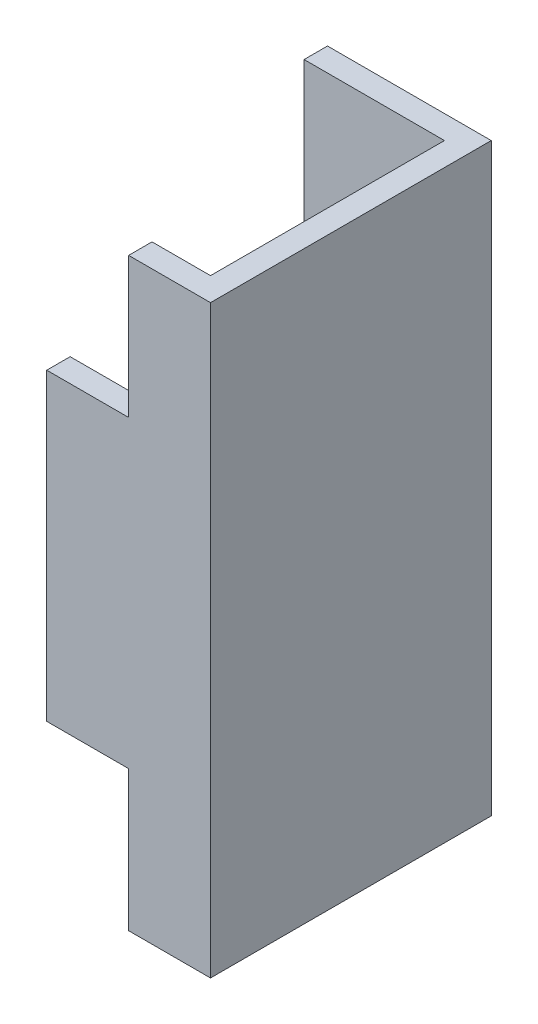
ISO-10303-21;
HEADER;
FILE_DESCRIPTION(('STEP AP214'),'2;1');
FILE_NAME('part.step','',(''),(''),'','','');
FILE_SCHEMA(('AUTOMOTIVE_DESIGN { 1 0 10303 214 1 1 1 1 }'));
ENDSEC;
DATA;
#1=APPLICATION_CONTEXT('core data for automotive mechanical design processes');
#2=APPLICATION_PROTOCOL_DEFINITION('international standard','automotive_design',2000,#1);
#3=PRODUCT_CONTEXT('',#1,'mechanical');
#4=PRODUCT('Part','Part','',(#3));
#5=PRODUCT_RELATED_PRODUCT_CATEGORY('part','',(#4));
#6=PRODUCT_DEFINITION_FORMATION('','',#4);
#7=PRODUCT_DEFINITION_CONTEXT('part definition',#1,'design');
#8=PRODUCT_DEFINITION('design','',#6,#7);
#9=PRODUCT_DEFINITION_SHAPE('','',#8);
#10=(LENGTH_UNIT() NAMED_UNIT(*) SI_UNIT(.MILLI.,.METRE.));
#11=(NAMED_UNIT(*) PLANE_ANGLE_UNIT() SI_UNIT($,.RADIAN.));
#12=(NAMED_UNIT(*) SI_UNIT($,.STERADIAN.) SOLID_ANGLE_UNIT());
#13=UNCERTAINTY_MEASURE_WITH_UNIT(LENGTH_MEASURE(1.E-05),#10,'distance_accuracy_value','');
#14=(GEOMETRIC_REPRESENTATION_CONTEXT(3) GLOBAL_UNCERTAINTY_ASSIGNED_CONTEXT((#13)) GLOBAL_UNIT_ASSIGNED_CONTEXT((#10,
#11,#12)) REPRESENTATION_CONTEXT('',''));
#15=CARTESIAN_POINT('',(0.,0.,0.));
#16=DIRECTION('',(0.,0.,1.));
#17=DIRECTION('',(1.,0.,0.));
#18=AXIS2_PLACEMENT_3D('',#15,#16,#17);
#19=CARTESIAN_POINT('',(0.,1.94462219947249,0.549999999999999));
#20=DIRECTION('',(0.,0.,1.));
#21=DIRECTION('',(1.,0.,0.));
#22=AXIS2_PLACEMENT_3D('',#19,#20,#21);
#23=PLANE('',#22);
#24=DIRECTION('',(0.,1.,0.));
#25=VECTOR('',#24,1.);
#26=CARTESIAN_POINT('',(1.775,0.95,0.549999999999999));
#27=LINE('',#26,#25);
#28=CARTESIAN_POINT('',(1.775,0.95,0.549999999999999));
#29=VERTEX_POINT('',#28);
#30=CARTESIAN_POINT('',(1.775,1.25,0.55));
#31=VERTEX_POINT('',#30);
#32=EDGE_CURVE('E11',#29,#31,#27,.T.);
#33=ORIENTED_EDGE('',*,*,#32,.F.);
#34=DIRECTION('',(1.,0.,0.));
#35=VECTOR('',#34,1.);
#36=CARTESIAN_POINT('',(1.6,0.95,0.549999999999999));
#37=LINE('',#36,#35);
#38=CARTESIAN_POINT('',(1.6,0.95,0.549999999999999));
#39=VERTEX_POINT('',#38);
#40=EDGE_CURVE('E200',#39,#29,#37,.T.);
#41=ORIENTED_EDGE('',*,*,#40,.F.);
#42=DIRECTION('',(0.,-1.,0.));
#43=VECTOR('',#42,1.);
#44=CARTESIAN_POINT('',(1.6,0.95,0.55));
#45=LINE('',#44,#43);
#46=CARTESIAN_POINT('',(1.6,0.3,0.549999999999999));
#47=VERTEX_POINT('',#46);
#48=EDGE_CURVE('E193',#39,#47,#45,.T.);
#49=ORIENTED_EDGE('',*,*,#48,.T.);
#50=DIRECTION('',(-1.,0.,0.));
#51=VECTOR('',#50,1.);
#52=CARTESIAN_POINT('',(1.775,0.3,0.549999999999999));
#53=LINE('',#52,#51);
#54=CARTESIAN_POINT('',(1.775,0.3,0.549999999999999));
#55=VERTEX_POINT('',#54);
#56=EDGE_CURVE('E184',#55,#47,#53,.T.);
#57=ORIENTED_EDGE('',*,*,#56,.F.);
#58=DIRECTION('',(0.,1.,0.));
#59=VECTOR('',#58,1.);
#60=CARTESIAN_POINT('',(1.775,0.,0.549999999999999));
#61=LINE('',#60,#59);
#62=CARTESIAN_POINT('',(1.775,0.,0.549999999999999));
#63=VERTEX_POINT('',#62);
#64=EDGE_CURVE('E122',#63,#55,#61,.T.);
#65=ORIENTED_EDGE('',*,*,#64,.F.);
#66=DIRECTION('',(-1.,0.,0.));
#67=VECTOR('',#66,1.);
#68=CARTESIAN_POINT('',(1.95,0.,0.55));
#69=LINE('',#68,#67);
#70=CARTESIAN_POINT('',(1.95,0.,0.55));
#71=VERTEX_POINT('',#70);
#72=EDGE_CURVE('E165',#71,#63,#69,.T.);
#73=ORIENTED_EDGE('',*,*,#72,.F.);
#74=DIRECTION('',(0.,-1.,0.));
#75=VECTOR('',#74,1.);
#76=CARTESIAN_POINT('',(1.95,1.25,0.55));
#77=LINE('',#76,#75);
#78=CARTESIAN_POINT('',(1.95,1.25,0.55));
#79=VERTEX_POINT('',#78);
#80=EDGE_CURVE('E195',#79,#71,#77,.T.);
#81=ORIENTED_EDGE('',*,*,#80,.F.);
#82=DIRECTION('',(1.,0.,0.));
#83=VECTOR('',#82,1.);
#84=CARTESIAN_POINT('',(1.775,1.25,0.55));
#85=LINE('',#84,#83);
#86=EDGE_CURVE('E146',#31,#79,#85,.T.);
#87=ORIENTED_EDGE('',*,*,#86,.F.);
#88=EDGE_LOOP('',(#33,#41,#49,#57,#65,#73,#81,#87));
#89=FACE_BOUND('',#88,.T.);
#90=ADVANCED_FACE('F17',(#89),#23,.T.);
#91=CARTESIAN_POINT('',(1.95,1.94462219947249,0.));
#92=DIRECTION('',(1.,0.,0.));
#93=DIRECTION('',(0.,0.,-1.));
#94=AXIS2_PLACEMENT_3D('',#91,#92,#93);
#95=PLANE('',#94);
#96=DIRECTION('',(0.,0.,-1.));
#97=VECTOR('',#96,1.);
#98=CARTESIAN_POINT('',(1.95,1.25,0.55));
#99=LINE('',#98,#97);
#100=CARTESIAN_POINT('',(1.95,1.25,-0.0499999999999999));
#101=VERTEX_POINT('',#100);
#102=EDGE_CURVE('E24',#79,#101,#99,.T.);
#103=ORIENTED_EDGE('',*,*,#102,.F.);
#104=ORIENTED_EDGE('',*,*,#80,.T.);
#105=DIRECTION('',(0.,0.,1.));
#106=VECTOR('',#105,1.);
#107=CARTESIAN_POINT('',(1.95,0.,-0.0499999999999999));
#108=LINE('',#107,#106);
#109=CARTESIAN_POINT('',(1.95,0.,-0.0499999999999999));
#110=VERTEX_POINT('',#109);
#111=EDGE_CURVE('E186',#110,#71,#108,.T.);
#112=ORIENTED_EDGE('',*,*,#111,.F.);
#113=DIRECTION('',(0.,-1.,0.));
#114=VECTOR('',#113,1.);
#115=CARTESIAN_POINT('',(1.95,1.25,-0.0499999999999999));
#116=LINE('',#115,#114);
#117=EDGE_CURVE('E189',#101,#110,#116,.T.);
#118=ORIENTED_EDGE('',*,*,#117,.F.);
#119=EDGE_LOOP('',(#103,#104,#112,#118));
#120=FACE_BOUND('',#119,.T.);
#121=ADVANCED_FACE('F209',(#120),#95,.T.);
#122=CARTESIAN_POINT('',(0.,1.94462219947249,-0.0500000000000001));
#123=DIRECTION('',(0.,0.,-1.));
#124=DIRECTION('',(-1.,0.,0.));
#125=AXIS2_PLACEMENT_3D('',#122,#123,#124);
#126=PLANE('',#125);
#127=DIRECTION('',(-1.,0.,0.));
#128=VECTOR('',#127,1.);
#129=CARTESIAN_POINT('',(1.95,1.25,-0.0499999999999999));
#130=LINE('',#129,#128);
#131=CARTESIAN_POINT('',(1.6,1.25,-0.0499999999999999));
#132=VERTEX_POINT('',#131);
#133=EDGE_CURVE('E197',#101,#132,#130,.T.);
#134=ORIENTED_EDGE('',*,*,#133,.F.);
#135=ORIENTED_EDGE('',*,*,#117,.T.);
#136=DIRECTION('',(1.,0.,0.));
#137=VECTOR('',#136,1.);
#138=CARTESIAN_POINT('',(1.6,0.,-0.0499999999999999));
#139=LINE('',#138,#137);
#140=CARTESIAN_POINT('',(1.6,0.,-0.0499999999999999));
#141=VERTEX_POINT('',#140);
#142=EDGE_CURVE('E177',#141,#110,#139,.T.);
#143=ORIENTED_EDGE('',*,*,#142,.F.);
#144=DIRECTION('',(0.,-1.,0.));
#145=VECTOR('',#144,1.);
#146=CARTESIAN_POINT('',(1.6,1.25,-0.0499999999999999));
#147=LINE('',#146,#145);
#148=EDGE_CURVE('E168',#132,#141,#147,.T.);
#149=ORIENTED_EDGE('',*,*,#148,.F.);
#150=EDGE_LOOP('',(#134,#135,#143,#149));
#151=FACE_BOUND('',#150,.T.);
#152=ADVANCED_FACE('F216',(#151),#126,.T.);
#153=CARTESIAN_POINT('',(1.6,1.94462219947249,0.));
#154=DIRECTION('',(1.,0.,0.));
#155=DIRECTION('',(0.,0.,-1.));
#156=AXIS2_PLACEMENT_3D('',#153,#154,#155);
#157=PLANE('',#156);
#158=DIRECTION('',(0.,-1.,0.));
#159=VECTOR('',#158,1.);
#160=CARTESIAN_POINT('',(1.6,1.25,0.));
#161=LINE('',#160,#159);
#162=CARTESIAN_POINT('',(1.6,1.25,0.));
#163=VERTEX_POINT('',#162);
#164=CARTESIAN_POINT('',(1.6,0.,0.));
#165=VERTEX_POINT('',#164);
#166=EDGE_CURVE('E191',#163,#165,#161,.T.);
#167=ORIENTED_EDGE('',*,*,#166,.F.);
#168=DIRECTION('',(0.,0.,-1.));
#169=VECTOR('',#168,1.);
#170=CARTESIAN_POINT('',(1.6,1.25,0.));
#171=LINE('',#170,#169);
#172=EDGE_CURVE('E180',#163,#132,#171,.T.);
#173=ORIENTED_EDGE('',*,*,#172,.T.);
#174=ORIENTED_EDGE('',*,*,#148,.T.);
#175=DIRECTION('',(0.,0.,1.));
#176=VECTOR('',#175,1.);
#177=CARTESIAN_POINT('',(1.6,0.,-0.0499999999999999));
#178=LINE('',#177,#176);
#179=EDGE_CURVE('E157',#141,#165,#178,.T.);
#180=ORIENTED_EDGE('',*,*,#179,.T.);
#181=EDGE_LOOP('',(#167,#173,#174,#180));
#182=FACE_BOUND('',#181,.T.);
#183=ADVANCED_FACE('F218',(#182),#157,.F.);
#184=CARTESIAN_POINT('',(0.,1.94462219947249,0.));
#185=DIRECTION('',(0.,0.,-1.));
#186=DIRECTION('',(-1.,0.,0.));
#187=AXIS2_PLACEMENT_3D('',#184,#185,#186);
#188=PLANE('',#187);
#189=DIRECTION('',(0.,-1.,0.));
#190=VECTOR('',#189,1.);
#191=CARTESIAN_POINT('',(1.9,1.25,0.));
#192=LINE('',#191,#190);
#193=CARTESIAN_POINT('',(1.9,1.25,0.));
#194=VERTEX_POINT('',#193);
#195=CARTESIAN_POINT('',(1.9,0.,0.));
#196=VERTEX_POINT('',#195);
#197=EDGE_CURVE('E182',#194,#196,#192,.T.);
#198=ORIENTED_EDGE('',*,*,#197,.F.);
#199=DIRECTION('',(-1.,0.,0.));
#200=VECTOR('',#199,1.);
#201=CARTESIAN_POINT('',(1.9,1.25,0.));
#202=LINE('',#201,#200);
#203=EDGE_CURVE('E171',#194,#163,#202,.T.);
#204=ORIENTED_EDGE('',*,*,#203,.T.);
#205=ORIENTED_EDGE('',*,*,#166,.T.);
#206=DIRECTION('',(1.,0.,0.));
#207=VECTOR('',#206,1.);
#208=CARTESIAN_POINT('',(1.6,0.,0.));
#209=LINE('',#208,#207);
#210=EDGE_CURVE('E149',#165,#196,#209,.T.);
#211=ORIENTED_EDGE('',*,*,#210,.T.);
#212=EDGE_LOOP('',(#198,#204,#205,#211));
#213=FACE_BOUND('',#212,.T.);
#214=ADVANCED_FACE('F222',(#213),#188,.F.);
#215=CARTESIAN_POINT('',(1.9,1.94462219947249,0.));
#216=DIRECTION('',(1.,0.,0.));
#217=DIRECTION('',(0.,0.,-1.));
#218=AXIS2_PLACEMENT_3D('',#215,#216,#217);
#219=PLANE('',#218);
#220=DIRECTION('',(0.,-1.,0.));
#221=VECTOR('',#220,1.);
#222=CARTESIAN_POINT('',(1.9,1.25,0.5));
#223=LINE('',#222,#221);
#224=CARTESIAN_POINT('',(1.9,1.25,0.5));
#225=VERTEX_POINT('',#224);
#226=CARTESIAN_POINT('',(1.9,0.,0.5));
#227=VERTEX_POINT('',#226);
#228=EDGE_CURVE('E174',#225,#227,#223,.T.);
#229=ORIENTED_EDGE('',*,*,#228,.F.);
#230=DIRECTION('',(0.,0.,-1.));
#231=VECTOR('',#230,1.);
#232=CARTESIAN_POINT('',(1.9,1.25,0.5));
#233=LINE('',#232,#231);
#234=EDGE_CURVE('E160',#225,#194,#233,.T.);
#235=ORIENTED_EDGE('',*,*,#234,.T.);
#236=ORIENTED_EDGE('',*,*,#197,.T.);
#237=DIRECTION('',(0.,0.,1.));
#238=VECTOR('',#237,1.);
#239=CARTESIAN_POINT('',(1.9,0.,0.));
#240=LINE('',#239,#238);
#241=EDGE_CURVE('E137',#196,#227,#240,.T.);
#242=ORIENTED_EDGE('',*,*,#241,.T.);
#243=EDGE_LOOP('',(#229,#235,#236,#242));
#244=FACE_BOUND('',#243,.T.);
#245=ADVANCED_FACE('F225',(#244),#219,.F.);
#246=CARTESIAN_POINT('',(0.,1.94462219947249,0.5));
#247=DIRECTION('',(0.,0.,1.));
#248=DIRECTION('',(1.,0.,0.));
#249=AXIS2_PLACEMENT_3D('',#246,#247,#248);
#250=PLANE('',#249);
#251=DIRECTION('',(1.,0.,0.));
#252=VECTOR('',#251,1.);
#253=CARTESIAN_POINT('',(1.6,0.95,0.5));
#254=LINE('',#253,#252);
#255=CARTESIAN_POINT('',(1.6,0.95,0.5));
#256=VERTEX_POINT('',#255);
#257=CARTESIAN_POINT('',(1.775,0.95,0.5));
#258=VERTEX_POINT('',#257);
#259=EDGE_CURVE('E163',#256,#258,#254,.T.);
#260=ORIENTED_EDGE('',*,*,#259,.T.);
#261=DIRECTION('',(0.,1.,0.));
#262=VECTOR('',#261,1.);
#263=CARTESIAN_POINT('',(1.775,0.95,0.5));
#264=LINE('',#263,#262);
#265=CARTESIAN_POINT('',(1.775,1.25,0.5));
#266=VERTEX_POINT('',#265);
#267=EDGE_CURVE('E152',#258,#266,#264,.T.);
#268=ORIENTED_EDGE('',*,*,#267,.T.);
#269=DIRECTION('',(1.,0.,0.));
#270=VECTOR('',#269,1.);
#271=CARTESIAN_POINT('',(1.775,1.25,0.5));
#272=LINE('',#271,#270);
#273=EDGE_CURVE('E139',#266,#225,#272,.T.);
#274=ORIENTED_EDGE('',*,*,#273,.T.);
#275=ORIENTED_EDGE('',*,*,#228,.T.);
#276=DIRECTION('',(-1.,0.,0.));
#277=VECTOR('',#276,1.);
#278=CARTESIAN_POINT('',(1.9,0.,0.5));
#279=LINE('',#278,#277);
#280=CARTESIAN_POINT('',(1.775,0.,0.5));
#281=VERTEX_POINT('',#280);
#282=EDGE_CURVE('E113',#227,#281,#279,.T.);
#283=ORIENTED_EDGE('',*,*,#282,.T.);
#284=DIRECTION('',(0.,1.,0.));
#285=VECTOR('',#284,1.);
#286=CARTESIAN_POINT('',(1.775,0.,0.5));
#287=LINE('',#286,#285);
#288=CARTESIAN_POINT('',(1.775,0.3,0.5));
#289=VERTEX_POINT('',#288);
#290=EDGE_CURVE('E104',#281,#289,#287,.T.);
#291=ORIENTED_EDGE('',*,*,#290,.T.);
#292=DIRECTION('',(-1.,0.,0.));
#293=VECTOR('',#292,1.);
#294=CARTESIAN_POINT('',(1.775,0.3,0.5));
#295=LINE('',#294,#293);
#296=CARTESIAN_POINT('',(1.6,0.3,0.5));
#297=VERTEX_POINT('',#296);
#298=EDGE_CURVE('E109',#289,#297,#295,.T.);
#299=ORIENTED_EDGE('',*,*,#298,.T.);
#300=DIRECTION('',(0.,-1.,0.));
#301=VECTOR('',#300,1.);
#302=CARTESIAN_POINT('',(1.6,0.95,0.5));
#303=LINE('',#302,#301);
#304=EDGE_CURVE('E142',#256,#297,#303,.T.);
#305=ORIENTED_EDGE('',*,*,#304,.F.);
#306=EDGE_LOOP('',(#260,#268,#274,#275,#283,#291,#299,#305));
#307=FACE_BOUND('',#306,.T.);
#308=ADVANCED_FACE('F106',(#307),#250,.F.);
#309=CARTESIAN_POINT('',(1.6,1.94462219947249,0.));
#310=DIRECTION('',(-1.,0.,0.));
#311=DIRECTION('',(0.,0.,1.));
#312=AXIS2_PLACEMENT_3D('',#309,#310,#311);
#313=PLANE('',#312);
#314=DIRECTION('',(0.,0.,1.));
#315=VECTOR('',#314,1.);
#316=CARTESIAN_POINT('',(1.6,0.95,0.5));
#317=LINE('',#316,#315);
#318=EDGE_CURVE('E154',#256,#39,#317,.T.);
#319=ORIENTED_EDGE('',*,*,#318,.F.);
#320=ORIENTED_EDGE('',*,*,#304,.T.);
#321=DIRECTION('',(0.,0.,1.));
#322=VECTOR('',#321,1.);
#323=CARTESIAN_POINT('',(1.6,0.3,0.5));
#324=LINE('',#323,#322);
#325=EDGE_CURVE('E128',#297,#47,#324,.T.);
#326=ORIENTED_EDGE('',*,*,#325,.T.);
#327=ORIENTED_EDGE('',*,*,#48,.F.);
#328=EDGE_LOOP('',(#319,#320,#326,#327));
#329=FACE_BOUND('',#328,.T.);
#330=ADVANCED_FACE('F235',(#329),#313,.T.);
#331=CARTESIAN_POINT('',(0.,0.,0.));
#332=DIRECTION('',(0.,-1.,0.));
#333=DIRECTION('',(0.,0.,-1.));
#334=AXIS2_PLACEMENT_3D('',#331,#332,#333);
#335=PLANE('',#334);
#336=DIRECTION('',(0.,0.,1.));
#337=VECTOR('',#336,1.);
#338=CARTESIAN_POINT('',(1.775,0.,0.5));
#339=LINE('',#338,#337);
#340=EDGE_CURVE('E144',#281,#63,#339,.T.);
#341=ORIENTED_EDGE('',*,*,#340,.F.);
#342=ORIENTED_EDGE('',*,*,#282,.F.);
#343=ORIENTED_EDGE('',*,*,#241,.F.);
#344=ORIENTED_EDGE('',*,*,#210,.F.);
#345=ORIENTED_EDGE('',*,*,#179,.F.);
#346=ORIENTED_EDGE('',*,*,#142,.T.);
#347=ORIENTED_EDGE('',*,*,#111,.T.);
#348=ORIENTED_EDGE('',*,*,#72,.T.);
#349=EDGE_LOOP('',(#341,#342,#343,#344,#345,#346,#347,#348));
#350=FACE_BOUND('',#349,.T.);
#351=ADVANCED_FACE('F212',(#350),#335,.T.);
#352=CARTESIAN_POINT('',(0.,1.25,0.5));
#353=DIRECTION('',(0.,-1.,0.));
#354=DIRECTION('',(0.,0.,-1.));
#355=AXIS2_PLACEMENT_3D('',#352,#353,#354);
#356=PLANE('',#355);
#357=ORIENTED_EDGE('',*,*,#273,.F.);
#358=DIRECTION('',(0.,0.,1.));
#359=VECTOR('',#358,1.);
#360=CARTESIAN_POINT('',(1.775,1.25,0.5));
#361=LINE('',#360,#359);
#362=EDGE_CURVE('E132',#266,#31,#361,.T.);
#363=ORIENTED_EDGE('',*,*,#362,.T.);
#364=ORIENTED_EDGE('',*,*,#86,.T.);
#365=ORIENTED_EDGE('',*,*,#102,.T.);
#366=ORIENTED_EDGE('',*,*,#133,.T.);
#367=ORIENTED_EDGE('',*,*,#172,.F.);
#368=ORIENTED_EDGE('',*,*,#203,.F.);
#369=ORIENTED_EDGE('',*,*,#234,.F.);
#370=EDGE_LOOP('',(#357,#363,#364,#365,#366,#367,#368,#369));
#371=FACE_BOUND('',#370,.T.);
#372=ADVANCED_FACE('F204',(#371),#356,.F.);
#373=CARTESIAN_POINT('',(1.6,0.95,0.449999999999999));
#374=DIRECTION('',(0.,-1.,0.));
#375=DIRECTION('',(0.,0.,-1.));
#376=AXIS2_PLACEMENT_3D('',#373,#374,#375);
#377=PLANE('',#376);
#378=ORIENTED_EDGE('',*,*,#318,.T.);
#379=ORIENTED_EDGE('',*,*,#40,.T.);
#380=DIRECTION('',(0.,0.,1.));
#381=VECTOR('',#380,1.);
#382=CARTESIAN_POINT('',(1.775,0.95,0.5));
#383=LINE('',#382,#381);
#384=EDGE_CURVE('E116',#258,#29,#383,.T.);
#385=ORIENTED_EDGE('',*,*,#384,.F.);
#386=ORIENTED_EDGE('',*,*,#259,.F.);
#387=EDGE_LOOP('',(#378,#379,#385,#386));
#388=FACE_BOUND('',#387,.T.);
#389=ADVANCED_FACE('F232',(#388),#377,.F.);
#390=CARTESIAN_POINT('',(1.775,1.25,0.449999999999999));
#391=DIRECTION('',(1.,0.,0.));
#392=DIRECTION('',(0.,0.,-1.));
#393=AXIS2_PLACEMENT_3D('',#390,#391,#392);
#394=PLANE('',#393);
#395=ORIENTED_EDGE('',*,*,#384,.T.);
#396=ORIENTED_EDGE('',*,*,#32,.T.);
#397=ORIENTED_EDGE('',*,*,#362,.F.);
#398=ORIENTED_EDGE('',*,*,#267,.F.);
#399=EDGE_LOOP('',(#395,#396,#397,#398));
#400=FACE_BOUND('',#399,.T.);
#401=ADVANCED_FACE('F228',(#400),#394,.F.);
#402=CARTESIAN_POINT('',(1.6,0.3,0.449999999999999));
#403=DIRECTION('',(0.,1.,0.));
#404=DIRECTION('',(0.,0.,1.));
#405=AXIS2_PLACEMENT_3D('',#402,#403,#404);
#406=PLANE('',#405);
#407=DIRECTION('',(0.,0.,1.));
#408=VECTOR('',#407,1.);
#409=CARTESIAN_POINT('',(1.775,0.3,0.5));
#410=LINE('',#409,#408);
#411=EDGE_CURVE('E117',#289,#55,#410,.T.);
#412=ORIENTED_EDGE('',*,*,#411,.T.);
#413=ORIENTED_EDGE('',*,*,#56,.T.);
#414=ORIENTED_EDGE('',*,*,#325,.F.);
#415=ORIENTED_EDGE('',*,*,#298,.F.);
#416=EDGE_LOOP('',(#412,#413,#414,#415));
#417=FACE_BOUND('',#416,.T.);
#418=ADVANCED_FACE('F126',(#417),#406,.F.);
#419=CARTESIAN_POINT('',(1.775,0.,0.449999999999999));
#420=DIRECTION('',(1.,0.,0.));
#421=DIRECTION('',(0.,0.,-1.));
#422=AXIS2_PLACEMENT_3D('',#419,#420,#421);
#423=PLANE('',#422);
#424=ORIENTED_EDGE('',*,*,#340,.T.);
#425=ORIENTED_EDGE('',*,*,#64,.T.);
#426=ORIENTED_EDGE('',*,*,#411,.F.);
#427=ORIENTED_EDGE('',*,*,#290,.F.);
#428=EDGE_LOOP('',(#424,#425,#426,#427));
#429=FACE_BOUND('',#428,.T.);
#430=ADVANCED_FACE('F121',(#429),#423,.F.);
#431=CLOSED_SHELL('',(#90,#121,#152,#183,#214,#245,#308,#330,#351,#372,#389,#401,#418,#430));
#432=MANIFOLD_SOLID_BREP('B1',#431);
#433=ADVANCED_BREP_SHAPE_REPRESENTATION('',(#18,#432),#14);
#434=SHAPE_DEFINITION_REPRESENTATION(#9,#433);
ENDSEC;
END-ISO-10303-21;
